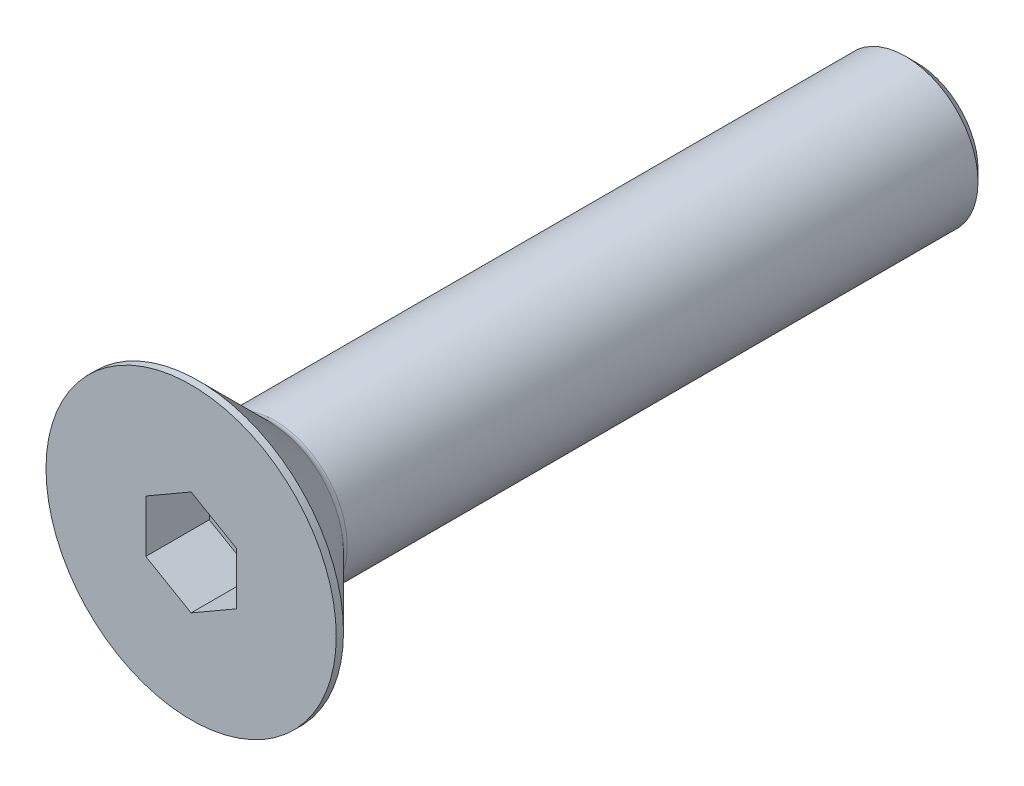
ISO-10303-21;
HEADER;
FILE_DESCRIPTION(('STEP AP214'),'2;1');
FILE_NAME('part.step','',(''),(''),'','','');
FILE_SCHEMA(('AUTOMOTIVE_DESIGN { 1 0 10303 214 1 1 1 1 }'));
ENDSEC;
DATA;
#1=APPLICATION_CONTEXT('core data for automotive mechanical design processes');
#2=APPLICATION_PROTOCOL_DEFINITION('international standard','automotive_design',2000,#1);
#3=PRODUCT_CONTEXT('',#1,'mechanical');
#4=PRODUCT('Part','Part','',(#3));
#5=PRODUCT_RELATED_PRODUCT_CATEGORY('part','',(#4));
#6=PRODUCT_DEFINITION_FORMATION('','',#4);
#7=PRODUCT_DEFINITION_CONTEXT('part definition',#1,'design');
#8=PRODUCT_DEFINITION('design','',#6,#7);
#9=PRODUCT_DEFINITION_SHAPE('','',#8);
#10=(LENGTH_UNIT() NAMED_UNIT(*) SI_UNIT(.MILLI.,.METRE.));
#11=(NAMED_UNIT(*) PLANE_ANGLE_UNIT() SI_UNIT($,.RADIAN.));
#12=(NAMED_UNIT(*) SI_UNIT($,.STERADIAN.) SOLID_ANGLE_UNIT());
#13=UNCERTAINTY_MEASURE_WITH_UNIT(LENGTH_MEASURE(1.E-05),#10,'distance_accuracy_value','');
#14=(GEOMETRIC_REPRESENTATION_CONTEXT(3) GLOBAL_UNCERTAINTY_ASSIGNED_CONTEXT((#13)) GLOBAL_UNIT_ASSIGNED_CONTEXT((#10,
#11,#12)) REPRESENTATION_CONTEXT('',''));
#15=CARTESIAN_POINT('',(0.,0.,0.));
#16=DIRECTION('',(0.,0.,1.));
#17=DIRECTION('',(1.,0.,0.));
#18=AXIS2_PLACEMENT_3D('',#15,#16,#17);
#19=CARTESIAN_POINT('',(0.,0.,-3.5));
#20=DIRECTION('',(0.,0.,1.));
#21=DIRECTION('',(1.,0.,0.));
#22=AXIS2_PLACEMENT_3D('',#19,#20,#21);
#23=PLANE('',#22);
#24=DIRECTION('',(-0.866025403784439,-0.5,0.));
#25=VECTOR('',#24,1.);
#26=CARTESIAN_POINT('',(0.,2.88675134594813,-3.5));
#27=LINE('',#26,#25);
#28=CARTESIAN_POINT('',(0.,2.88675134594813,-3.5));
#29=VERTEX_POINT('',#28);
#30=CARTESIAN_POINT('',(-2.5,1.44337567297406,-3.5));
#31=VERTEX_POINT('',#30);
#32=EDGE_CURVE('E82',#29,#31,#27,.T.);
#33=ORIENTED_EDGE('',*,*,#32,.T.);
#34=DIRECTION('',(0.,1.,0.));
#35=VECTOR('',#34,1.);
#36=CARTESIAN_POINT('',(-2.5,1.44337567297406,-3.5));
#37=LINE('',#36,#35);
#38=CARTESIAN_POINT('',(-2.5,-1.44337567297407,-3.5));
#39=VERTEX_POINT('',#38);
#40=EDGE_CURVE('E66',#31,#39,#37,.F.);
#41=ORIENTED_EDGE('',*,*,#40,.T.);
#42=DIRECTION('',(0.866025403784439,-0.499999999999999,0.));
#43=VECTOR('',#42,1.);
#44=CARTESIAN_POINT('',(-2.5,-1.44337567297407,-3.5));
#45=LINE('',#44,#43);
#46=CARTESIAN_POINT('',(0.,-2.88675134594813,-3.5));
#47=VERTEX_POINT('',#46);
#48=EDGE_CURVE('E71',#39,#47,#45,.T.);
#49=ORIENTED_EDGE('',*,*,#48,.T.);
#50=DIRECTION('',(0.866025403784439,0.5,0.));
#51=VECTOR('',#50,1.);
#52=CARTESIAN_POINT('',(0.,-2.88675134594813,-3.5));
#53=LINE('',#52,#51);
#54=CARTESIAN_POINT('',(2.5,-1.44337567297406,-3.5));
#55=VERTEX_POINT('',#54);
#56=EDGE_CURVE('E128',#47,#55,#53,.T.);
#57=ORIENTED_EDGE('',*,*,#56,.T.);
#58=DIRECTION('',(0.,1.,0.));
#59=VECTOR('',#58,1.);
#60=CARTESIAN_POINT('',(2.5,-1.44337567297406,-3.5));
#61=LINE('',#60,#59);
#62=CARTESIAN_POINT('',(2.5,1.44337567297407,-3.5));
#63=VERTEX_POINT('',#62);
#64=EDGE_CURVE('E132',#55,#63,#61,.T.);
#65=ORIENTED_EDGE('',*,*,#64,.T.);
#66=DIRECTION('',(-0.866025403784439,0.499999999999999,0.));
#67=VECTOR('',#66,1.);
#68=CARTESIAN_POINT('',(2.5,1.44337567297407,-3.5));
#69=LINE('',#68,#67);
#70=EDGE_CURVE('E137',#63,#29,#69,.T.);
#71=ORIENTED_EDGE('',*,*,#70,.T.);
#72=EDGE_LOOP('',(#33,#41,#49,#57,#65,#71));
#73=FACE_BOUND('',#72,.T.);
#74=ADVANCED_FACE('F15',(#73),#23,.T.);
#75=CARTESIAN_POINT('',(-2.5,-1.44337567297407,0.));
#76=DIRECTION('',(-0.499999999999999,-0.866025403784439,0.));
#77=DIRECTION('',(0.866025403784439,-0.499999999999999,0.));
#78=AXIS2_PLACEMENT_3D('',#75,#76,#77);
#79=PLANE('',#78);
#80=DIRECTION('',(0.,0.,1.));
#81=VECTOR('',#80,1.);
#82=CARTESIAN_POINT('',(-2.5,-1.44337567297407,0.));
#83=LINE('',#82,#81);
#84=CARTESIAN_POINT('',(-2.5,-1.44337567297407,0.));
#85=VERTEX_POINT('',#84);
#86=EDGE_CURVE('E73',#39,#85,#83,.T.);
#87=ORIENTED_EDGE('',*,*,#86,.T.);
#88=DIRECTION('',(-0.866025403784439,0.499999999999999,0.));
#89=VECTOR('',#88,1.);
#90=CARTESIAN_POINT('',(0.,-2.88675134594813,0.));
#91=LINE('',#90,#89);
#92=CARTESIAN_POINT('',(0.,-2.88675134594813,0.));
#93=VERTEX_POINT('',#92);
#94=EDGE_CURVE('E126',#93,#85,#91,.T.);
#95=ORIENTED_EDGE('',*,*,#94,.F.);
#96=DIRECTION('',(0.,0.,1.));
#97=VECTOR('',#96,1.);
#98=CARTESIAN_POINT('',(0.,-2.88675134594813,0.));
#99=LINE('',#98,#97);
#100=EDGE_CURVE('E76',#93,#47,#99,.F.);
#101=ORIENTED_EDGE('',*,*,#100,.T.);
#102=ORIENTED_EDGE('',*,*,#48,.F.);
#103=EDGE_LOOP('',(#87,#95,#101,#102));
#104=FACE_BOUND('',#103,.T.);
#105=ADVANCED_FACE('F72',(#104),#79,.F.);
#106=CARTESIAN_POINT('',(-2.5,1.44337567297406,0.));
#107=DIRECTION('',(-1.,0.,0.));
#108=DIRECTION('',(0.,0.,1.));
#109=AXIS2_PLACEMENT_3D('',#106,#107,#108);
#110=PLANE('',#109);
#111=DIRECTION('',(0.,0.,1.));
#112=VECTOR('',#111,1.);
#113=CARTESIAN_POINT('',(-2.5,1.44337567297406,0.));
#114=LINE('',#113,#112);
#115=CARTESIAN_POINT('',(-2.5,1.44337567297406,0.));
#116=VERTEX_POINT('',#115);
#117=EDGE_CURVE('E84',#31,#116,#114,.T.);
#118=ORIENTED_EDGE('',*,*,#117,.T.);
#119=DIRECTION('',(0.,1.,0.));
#120=VECTOR('',#119,1.);
#121=CARTESIAN_POINT('',(-2.5,0.,0.));
#122=LINE('',#121,#120);
#123=EDGE_CURVE('E88',#85,#116,#122,.T.);
#124=ORIENTED_EDGE('',*,*,#123,.F.);
#125=ORIENTED_EDGE('',*,*,#86,.F.);
#126=ORIENTED_EDGE('',*,*,#40,.F.);
#127=EDGE_LOOP('',(#118,#124,#125,#126));
#128=FACE_BOUND('',#127,.T.);
#129=ADVANCED_FACE('F86',(#128),#110,.F.);
#130=CARTESIAN_POINT('',(0.,2.88675134594813,0.));
#131=DIRECTION('',(-0.5,0.866025403784439,0.));
#132=DIRECTION('',(-0.866025403784439,-0.5,0.));
#133=AXIS2_PLACEMENT_3D('',#130,#131,#132);
#134=PLANE('',#133);
#135=DIRECTION('',(0.,0.,1.));
#136=VECTOR('',#135,1.);
#137=CARTESIAN_POINT('',(0.,2.88675134594813,0.));
#138=LINE('',#137,#136);
#139=CARTESIAN_POINT('',(0.,2.88675134594813,0.));
#140=VERTEX_POINT('',#139);
#141=EDGE_CURVE('E139',#29,#140,#138,.T.);
#142=ORIENTED_EDGE('',*,*,#141,.T.);
#143=DIRECTION('',(0.866025403784439,0.499999999999999,0.));
#144=VECTOR('',#143,1.);
#145=CARTESIAN_POINT('',(-2.5,1.44337567297406,0.));
#146=LINE('',#145,#144);
#147=EDGE_CURVE('E122',#116,#140,#146,.T.);
#148=ORIENTED_EDGE('',*,*,#147,.F.);
#149=ORIENTED_EDGE('',*,*,#117,.F.);
#150=ORIENTED_EDGE('',*,*,#32,.F.);
#151=EDGE_LOOP('',(#142,#148,#149,#150));
#152=FACE_BOUND('',#151,.T.);
#153=ADVANCED_FACE('F143',(#152),#134,.F.);
#154=CARTESIAN_POINT('',(2.5,1.44337567297407,0.));
#155=DIRECTION('',(0.499999999999999,0.866025403784439,0.));
#156=DIRECTION('',(-0.866025403784439,0.499999999999999,0.));
#157=AXIS2_PLACEMENT_3D('',#154,#155,#156);
#158=PLANE('',#157);
#159=DIRECTION('',(0.,0.,-1.));
#160=VECTOR('',#159,1.);
#161=CARTESIAN_POINT('',(2.5,1.44337567297407,0.));
#162=LINE('',#161,#160);
#163=CARTESIAN_POINT('',(2.5,1.44337567297407,0.));
#164=VERTEX_POINT('',#163);
#165=EDGE_CURVE('E135',#63,#164,#162,.F.);
#166=ORIENTED_EDGE('',*,*,#165,.T.);
#167=DIRECTION('',(0.866025403784439,-0.499999999999999,0.));
#168=VECTOR('',#167,1.);
#169=CARTESIAN_POINT('',(0.,2.88675134594813,0.));
#170=LINE('',#169,#168);
#171=EDGE_CURVE('E119',#140,#164,#170,.T.);
#172=ORIENTED_EDGE('',*,*,#171,.F.);
#173=ORIENTED_EDGE('',*,*,#141,.F.);
#174=ORIENTED_EDGE('',*,*,#70,.F.);
#175=EDGE_LOOP('',(#166,#172,#173,#174));
#176=FACE_BOUND('',#175,.T.);
#177=ADVANCED_FACE('F154',(#176),#158,.F.);
#178=CARTESIAN_POINT('',(2.5,-1.44337567297406,0.));
#179=DIRECTION('',(1.,0.,0.));
#180=DIRECTION('',(0.,0.,-1.));
#181=AXIS2_PLACEMENT_3D('',#178,#179,#180);
#182=PLANE('',#181);
#183=DIRECTION('',(0.,0.,1.));
#184=VECTOR('',#183,1.);
#185=CARTESIAN_POINT('',(2.5,-1.44337567297406,0.));
#186=LINE('',#185,#184);
#187=CARTESIAN_POINT('',(2.5,-1.44337567297406,0.));
#188=VERTEX_POINT('',#187);
#189=EDGE_CURVE('E34',#55,#188,#186,.T.);
#190=ORIENTED_EDGE('',*,*,#189,.T.);
#191=DIRECTION('',(0.,1.,0.));
#192=VECTOR('',#191,1.);
#193=CARTESIAN_POINT('',(2.5,0.,0.));
#194=LINE('',#193,#192);
#195=EDGE_CURVE('E116',#164,#188,#194,.F.);
#196=ORIENTED_EDGE('',*,*,#195,.F.);
#197=ORIENTED_EDGE('',*,*,#165,.F.);
#198=ORIENTED_EDGE('',*,*,#64,.F.);
#199=EDGE_LOOP('',(#190,#196,#197,#198));
#200=FACE_BOUND('',#199,.T.);
#201=ADVANCED_FACE('F152',(#200),#182,.F.);
#202=CARTESIAN_POINT('',(0.,-2.88675134594813,0.));
#203=DIRECTION('',(0.5,-0.866025403784439,0.));
#204=DIRECTION('',(0.866025403784439,0.5,0.));
#205=AXIS2_PLACEMENT_3D('',#202,#203,#204);
#206=PLANE('',#205);
#207=ORIENTED_EDGE('',*,*,#100,.F.);
#208=DIRECTION('',(-0.866025403784439,-0.499999999999999,0.));
#209=VECTOR('',#208,1.);
#210=CARTESIAN_POINT('',(2.5,-1.44337567297406,0.));
#211=LINE('',#210,#209);
#212=EDGE_CURVE('E113',#188,#93,#211,.T.);
#213=ORIENTED_EDGE('',*,*,#212,.F.);
#214=ORIENTED_EDGE('',*,*,#189,.F.);
#215=ORIENTED_EDGE('',*,*,#56,.F.);
#216=EDGE_LOOP('',(#207,#213,#214,#215));
#217=FACE_BOUND('',#216,.T.);
#218=ADVANCED_FACE('F150',(#217),#206,.F.);
#219=CARTESIAN_POINT('',(4.,0.,0.));
#220=DIRECTION('',(0.,0.,1.));
#221=DIRECTION('',(1.,0.,0.));
#222=AXIS2_PLACEMENT_3D('',#219,#220,#221);
#223=PLANE('',#222);
#224=ORIENTED_EDGE('',*,*,#195,.T.);
#225=ORIENTED_EDGE('',*,*,#212,.T.);
#226=ORIENTED_EDGE('',*,*,#94,.T.);
#227=ORIENTED_EDGE('',*,*,#123,.T.);
#228=ORIENTED_EDGE('',*,*,#147,.T.);
#229=ORIENTED_EDGE('',*,*,#171,.T.);
#230=EDGE_LOOP('',(#224,#225,#226,#227,#228,#229));
#231=FACE_BOUND('',#230,.T.);
#232=CARTESIAN_POINT('',(0.,0.,0.));
#233=DIRECTION('',(0.,0.,-1.));
#234=DIRECTION('',(-1.,0.,0.));
#235=AXIS2_PLACEMENT_3D('',#232,#233,#234);
#236=CIRCLE('',#235,8.);
#237=CARTESIAN_POINT('',(-8.,0.,0.));
#238=VERTEX_POINT('',#237);
#239=EDGE_CURVE('E19',#238,#238,#236,.T.);
#240=ORIENTED_EDGE('',*,*,#239,.F.);
#241=EDGE_LOOP('',(#240));
#242=FACE_BOUND('',#241,.T.);
#243=ADVANCED_FACE('F147',(#231,#242),#223,.T.);
#244=CARTESIAN_POINT('',(0.,0.,-0.2));
#245=DIRECTION('',(0.,0.,-1.));
#246=DIRECTION('',(-1.,0.,0.));
#247=AXIS2_PLACEMENT_3D('',#244,#245,#246);
#248=CYLINDRICAL_SURFACE('',#247,8.);
#249=ORIENTED_EDGE('',*,*,#239,.T.);
#250=EDGE_LOOP('',(#249));
#251=FACE_BOUND('',#250,.T.);
#252=CARTESIAN_POINT('',(0.,0.,-0.399999998251133));
#253=DIRECTION('',(0.,0.,1.));
#254=DIRECTION('',(1.,0.,0.));
#255=AXIS2_PLACEMENT_3D('',#252,#253,#254);
#256=CIRCLE('',#255,7.99999999821921);
#257=CARTESIAN_POINT('',(7.99999999821921,0.,-0.399999998251133));
#258=VERTEX_POINT('',#257);
#259=EDGE_CURVE('E100',#258,#258,#256,.F.);
#260=ORIENTED_EDGE('',*,*,#259,.F.);
#261=EDGE_LOOP('',(#260));
#262=FACE_BOUND('',#261,.T.);
#263=ADVANCED_FACE('F183',(#251,#262),#248,.T.);
#264=CARTESIAN_POINT('',(0.,0.,-0.399999998251133));
#265=DIRECTION('',(0.,0.,1.));
#266=DIRECTION('',(1.,0.,0.));
#267=AXIS2_PLACEMENT_3D('',#264,#265,#266);
#268=CONICAL_SURFACE('',#267,7.99999999821921,0.785398162505018);
#269=CARTESIAN_POINT('',(0.,0.,-4.25355339059328));
#270=DIRECTION('',(0.,0.,-1.));
#271=DIRECTION('',(0.,1.,0.));
#272=AXIS2_PLACEMENT_3D('',#269,#270,#271);
#273=CIRCLE('',#272,4.14644660940673);
#274=CARTESIAN_POINT('',(0.,4.14644660940673,-4.25355339059328));
#275=VERTEX_POINT('',#274);
#276=EDGE_CURVE('E94',#275,#275,#273,.T.);
#277=ORIENTED_EDGE('',*,*,#276,.F.);
#278=EDGE_LOOP('',(#277));
#279=FACE_BOUND('',#278,.T.);
#280=ORIENTED_EDGE('',*,*,#259,.T.);
#281=EDGE_LOOP('',(#280));
#282=FACE_BOUND('',#281,.T.);
#283=ADVANCED_FACE('F179',(#279,#282),#268,.T.);
#284=CARTESIAN_POINT('',(2.,0.,-40.));
#285=DIRECTION('',(0.,0.,-1.));
#286=DIRECTION('',(-1.,0.,0.));
#287=AXIS2_PLACEMENT_3D('',#284,#285,#286);
#288=PLANE('',#287);
#289=CARTESIAN_POINT('',(0.,0.,-40.0000000003047));
#290=DIRECTION('',(0.,0.,1.));
#291=DIRECTION('',(1.,0.,0.));
#292=AXIS2_PLACEMENT_3D('',#289,#290,#291);
#293=CIRCLE('',#292,3.37500000028967);
#294=CARTESIAN_POINT('',(3.37500000028967,0.,-40.0000000003047));
#295=VERTEX_POINT('',#294);
#296=EDGE_CURVE('E92',#295,#295,#293,.T.);
#297=ORIENTED_EDGE('',*,*,#296,.F.);
#298=EDGE_LOOP('',(#297));
#299=FACE_BOUND('',#298,.T.);
#300=ADVANCED_FACE('F176',(#299),#288,.T.);
#301=CARTESIAN_POINT('',(0.,0.,-4.60710678118655));
#302=DIRECTION('',(0.,0.,-1.));
#303=DIRECTION('',(-1.,0.,0.));
#304=AXIS2_PLACEMENT_3D('',#301,#302,#303);
#305=TOROIDAL_SURFACE('',#304,4.5,0.5);
#306=CARTESIAN_POINT('',(0.,0.,-4.60710678118655));
#307=DIRECTION('',(0.,0.,-1.));
#308=DIRECTION('',(-1.,0.,0.));
#309=AXIS2_PLACEMENT_3D('',#306,#307,#308);
#310=CIRCLE('',#309,4.);
#311=CARTESIAN_POINT('',(-4.,0.,-4.60710678118655));
#312=VERTEX_POINT('',#311);
#313=EDGE_CURVE('E25',#312,#312,#310,.T.);
#314=ORIENTED_EDGE('',*,*,#313,.F.);
#315=EDGE_LOOP('',(#314));
#316=FACE_BOUND('',#315,.T.);
#317=ORIENTED_EDGE('',*,*,#276,.T.);
#318=EDGE_LOOP('',(#317));
#319=FACE_BOUND('',#318,.T.);
#320=ADVANCED_FACE('F17',(#316,#319),#305,.F.);
#321=CARTESIAN_POINT('',(0.,0.,-39.3749999997226));
#322=DIRECTION('',(0.,0.,1.));
#323=DIRECTION('',(1.,0.,0.));
#324=AXIS2_PLACEMENT_3D('',#321,#322,#323);
#325=CONICAL_SURFACE('',#324,3.99999999973488,0.785398162487954);
#326=ORIENTED_EDGE('',*,*,#296,.T.);
#327=EDGE_LOOP('',(#326));
#328=FACE_BOUND('',#327,.T.);
#329=CARTESIAN_POINT('',(0.,0.,-39.375));
#330=DIRECTION('',(0.,0.,-1.));
#331=DIRECTION('',(-1.,0.,0.));
#332=AXIS2_PLACEMENT_3D('',#329,#330,#331);
#333=CIRCLE('',#332,4.);
#334=CARTESIAN_POINT('',(-4.,0.,-39.375));
#335=VERTEX_POINT('',#334);
#336=EDGE_CURVE('E10',#335,#335,#333,.F.);
#337=ORIENTED_EDGE('',*,*,#336,.F.);
#338=EDGE_LOOP('',(#337));
#339=FACE_BOUND('',#338,.T.);
#340=ADVANCED_FACE('F166',(#328,#339),#325,.T.);
#341=CARTESIAN_POINT('',(0.,0.,-22.2));
#342=DIRECTION('',(0.,0.,-1.));
#343=DIRECTION('',(-1.,0.,0.));
#344=AXIS2_PLACEMENT_3D('',#341,#342,#343);
#345=CYLINDRICAL_SURFACE('',#344,4.);
#346=ORIENTED_EDGE('',*,*,#336,.T.);
#347=EDGE_LOOP('',(#346));
#348=FACE_BOUND('',#347,.T.);
#349=ORIENTED_EDGE('',*,*,#313,.T.);
#350=EDGE_LOOP('',(#349));
#351=FACE_BOUND('',#350,.T.);
#352=ADVANCED_FACE('F164',(#348,#351),#345,.T.);
#353=CLOSED_SHELL('',(#74,#105,#129,#153,#177,#201,#218,#243,#263,#283,#300,#320,#340,#352));
#354=MANIFOLD_SOLID_BREP('B1',#353);
#355=ADVANCED_BREP_SHAPE_REPRESENTATION('',(#18,#354),#14);
#356=SHAPE_DEFINITION_REPRESENTATION(#9,#355);
ENDSEC;
END-ISO-10303-21;
